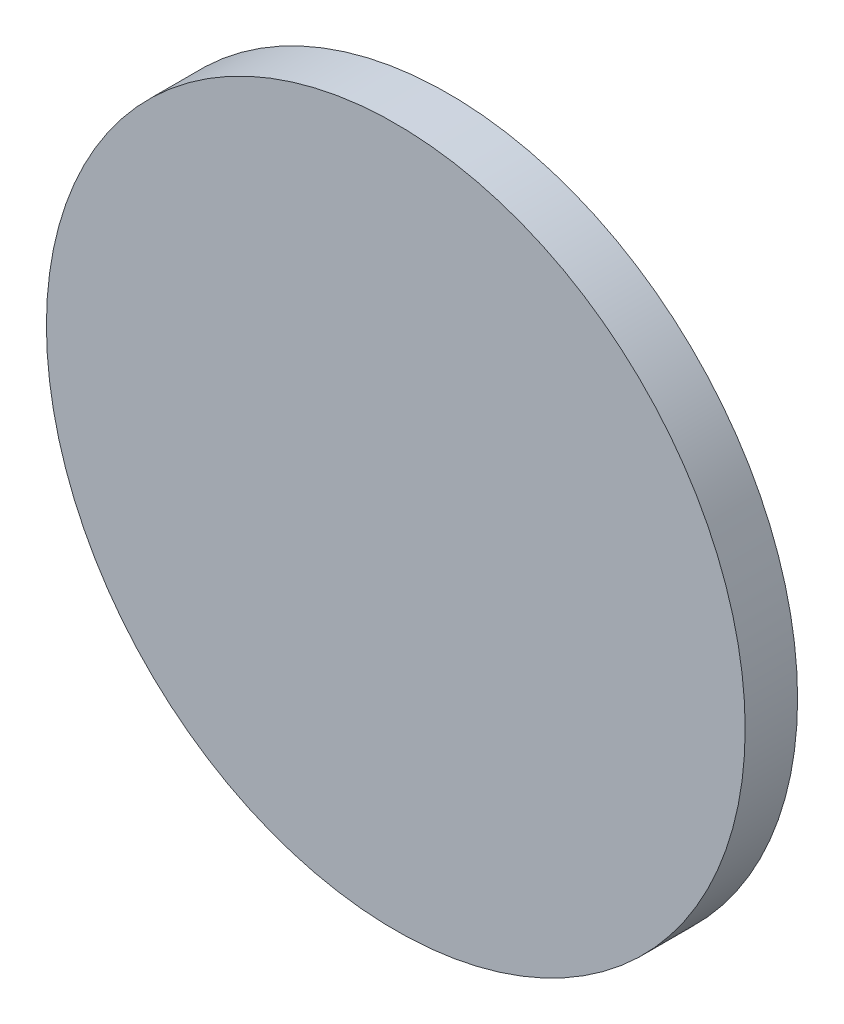
ISO-10303-21;
HEADER;
FILE_DESCRIPTION(('STEP AP214'),'2;1');
FILE_NAME('part.step','',(''),(''),'','','');
FILE_SCHEMA(('AUTOMOTIVE_DESIGN { 1 0 10303 214 1 1 1 1 }'));
ENDSEC;
DATA;
#1=APPLICATION_CONTEXT('core data for automotive mechanical design processes');
#2=APPLICATION_PROTOCOL_DEFINITION('international standard','automotive_design',2000,#1);
#3=PRODUCT_CONTEXT('',#1,'mechanical');
#4=PRODUCT('Part','Part','',(#3));
#5=PRODUCT_RELATED_PRODUCT_CATEGORY('part','',(#4));
#6=PRODUCT_DEFINITION_FORMATION('','',#4);
#7=PRODUCT_DEFINITION_CONTEXT('part definition',#1,'design');
#8=PRODUCT_DEFINITION('design','',#6,#7);
#9=PRODUCT_DEFINITION_SHAPE('','',#8);
#10=(LENGTH_UNIT() NAMED_UNIT(*) SI_UNIT(.MILLI.,.METRE.));
#11=(NAMED_UNIT(*) PLANE_ANGLE_UNIT() SI_UNIT($,.RADIAN.));
#12=(NAMED_UNIT(*) SI_UNIT($,.STERADIAN.) SOLID_ANGLE_UNIT());
#13=UNCERTAINTY_MEASURE_WITH_UNIT(LENGTH_MEASURE(1.E-05),#10,'distance_accuracy_value','');
#14=(GEOMETRIC_REPRESENTATION_CONTEXT(3) GLOBAL_UNCERTAINTY_ASSIGNED_CONTEXT((#13)) GLOBAL_UNIT_ASSIGNED_CONTEXT((#10,
#11,#12)) REPRESENTATION_CONTEXT('',''));
#15=CARTESIAN_POINT('',(0.,0.,0.));
#16=DIRECTION('',(0.,0.,1.));
#17=DIRECTION('',(1.,0.,0.));
#18=AXIS2_PLACEMENT_3D('',#15,#16,#17);
#19=CARTESIAN_POINT('',(12.53916,12.10491,0.76487));
#20=DIRECTION('',(0.,0.,-1.));
#21=DIRECTION('',(-1.,0.,0.));
#22=AXIS2_PLACEMENT_3D('',#19,#20,#21);
#23=PLANE('',#22);
#24=CARTESIAN_POINT('',(12.53916,12.10491,0.76487));
#25=DIRECTION('',(0.,0.,1.));
#26=DIRECTION('',(1.,0.,0.));
#27=AXIS2_PLACEMENT_3D('',#24,#25,#26);
#28=CIRCLE('',#27,0.2286);
#29=CARTESIAN_POINT('',(12.76776,12.10491,0.76487));
#30=VERTEX_POINT('',#29);
#31=EDGE_CURVE('E18',#30,#30,#28,.T.);
#32=ORIENTED_EDGE('',*,*,#31,.F.);
#33=EDGE_LOOP('',(#32));
#34=FACE_BOUND('',#33,.T.);
#35=ADVANCED_FACE('F15',(#34),#23,.T.);
#36=CARTESIAN_POINT('',(12.53916,12.10491,0.76487));
#37=DIRECTION('',(0.,0.,1.));
#38=DIRECTION('',(1.,0.,0.));
#39=AXIS2_PLACEMENT_3D('',#36,#37,#38);
#40=CYLINDRICAL_SURFACE('',#39,0.2286);
#41=CARTESIAN_POINT('',(12.53916,12.10491,0.79916));
#42=DIRECTION('',(0.,0.,1.));
#43=DIRECTION('',(1.,0.,0.));
#44=AXIS2_PLACEMENT_3D('',#41,#42,#43);
#45=CIRCLE('',#44,0.2286);
#46=CARTESIAN_POINT('',(12.76776,12.10491,0.79916));
#47=VERTEX_POINT('',#46);
#48=EDGE_CURVE('E10',#47,#47,#45,.T.);
#49=ORIENTED_EDGE('',*,*,#48,.F.);
#50=EDGE_LOOP('',(#49));
#51=FACE_BOUND('',#50,.T.);
#52=ORIENTED_EDGE('',*,*,#31,.T.);
#53=EDGE_LOOP('',(#52));
#54=FACE_BOUND('',#53,.T.);
#55=ADVANCED_FACE('F27',(#51,#54),#40,.T.);
#56=CARTESIAN_POINT('',(12.53916,12.10491,0.79916));
#57=DIRECTION('',(0.,0.,1.));
#58=DIRECTION('',(1.,0.,0.));
#59=AXIS2_PLACEMENT_3D('',#56,#57,#58);
#60=PLANE('',#59);
#61=ORIENTED_EDGE('',*,*,#48,.T.);
#62=EDGE_LOOP('',(#61));
#63=FACE_BOUND('',#62,.T.);
#64=ADVANCED_FACE('F34',(#63),#60,.T.);
#65=CLOSED_SHELL('',(#35,#55,#64));
#66=MANIFOLD_SOLID_BREP('B1',#65);
#67=ADVANCED_BREP_SHAPE_REPRESENTATION('',(#18,#66),#14);
#68=SHAPE_DEFINITION_REPRESENTATION(#9,#67);
ENDSEC;
END-ISO-10303-21;
